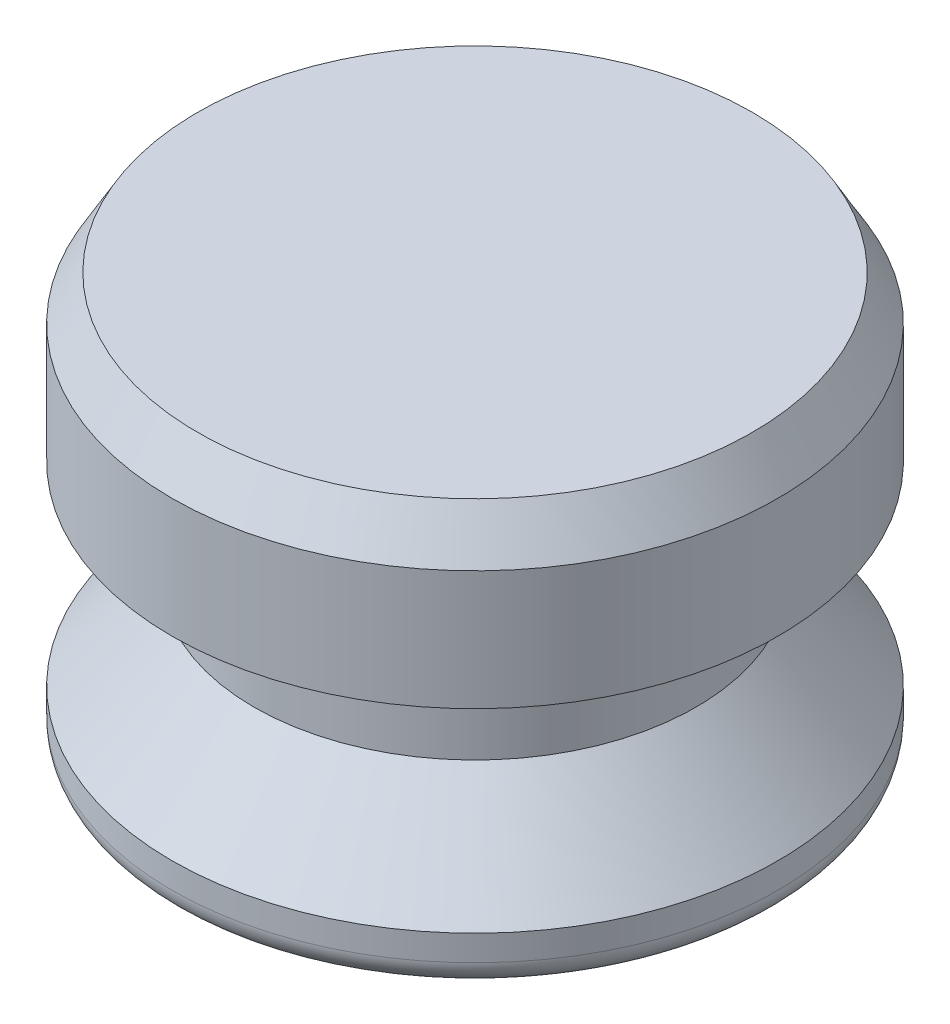
ISO-10303-21;
HEADER;
FILE_DESCRIPTION(('STEP AP214'),'2;1');
FILE_NAME('part.step','',(''),(''),'','','');
FILE_SCHEMA(('AUTOMOTIVE_DESIGN { 1 0 10303 214 1 1 1 1 }'));
ENDSEC;
DATA;
#1=APPLICATION_CONTEXT('core data for automotive mechanical design processes');
#2=APPLICATION_PROTOCOL_DEFINITION('international standard','automotive_design',2000,#1);
#3=PRODUCT_CONTEXT('',#1,'mechanical');
#4=PRODUCT('Part','Part','',(#3));
#5=PRODUCT_RELATED_PRODUCT_CATEGORY('part','',(#4));
#6=PRODUCT_DEFINITION_FORMATION('','',#4);
#7=PRODUCT_DEFINITION_CONTEXT('part definition',#1,'design');
#8=PRODUCT_DEFINITION('design','',#6,#7);
#9=PRODUCT_DEFINITION_SHAPE('','',#8);
#10=(LENGTH_UNIT() NAMED_UNIT(*) SI_UNIT(.MILLI.,.METRE.));
#11=(NAMED_UNIT(*) PLANE_ANGLE_UNIT() SI_UNIT($,.RADIAN.));
#12=(NAMED_UNIT(*) SI_UNIT($,.STERADIAN.) SOLID_ANGLE_UNIT());
#13=UNCERTAINTY_MEASURE_WITH_UNIT(LENGTH_MEASURE(1.E-05),#10,'distance_accuracy_value','');
#14=(GEOMETRIC_REPRESENTATION_CONTEXT(3) GLOBAL_UNCERTAINTY_ASSIGNED_CONTEXT((#13)) GLOBAL_UNIT_ASSIGNED_CONTEXT((#10,
#11,#12)) REPRESENTATION_CONTEXT('',''));
#15=CARTESIAN_POINT('',(0.,0.,0.));
#16=DIRECTION('',(0.,0.,1.));
#17=DIRECTION('',(1.,0.,0.));
#18=AXIS2_PLACEMENT_3D('',#15,#16,#17);
#19=CARTESIAN_POINT('',(0.,0.,0.));
#20=DIRECTION('',(0.,1.,0.));
#21=DIRECTION('',(0.,0.,1.));
#22=AXIS2_PLACEMENT_3D('',#19,#20,#21);
#23=PLANE('',#22);
#24=CARTESIAN_POINT('',(0.,0.,0.));
#25=DIRECTION('',(0.,1.,0.));
#26=DIRECTION('',(0.,0.,1.));
#27=AXIS2_PLACEMENT_3D('',#24,#25,#26);
#28=CIRCLE('',#27,8.60425);
#29=CARTESIAN_POINT('',(0.,0.,8.60425));
#30=VERTEX_POINT('',#29);
#31=EDGE_CURVE('E46',#30,#30,#28,.F.);
#32=ORIENTED_EDGE('',*,*,#31,.T.);
#33=EDGE_LOOP('',(#32));
#34=FACE_BOUND('',#33,.T.);
#35=ADVANCED_FACE('F31',(#34),#23,.F.);
#36=CARTESIAN_POINT('',(0.,0.,0.));
#37=DIRECTION('',(0.,-1.,0.));
#38=DIRECTION('',(0.,0.,-1.));
#39=AXIS2_PLACEMENT_3D('',#36,#37,#38);
#40=CYLINDRICAL_SURFACE('',#39,9.398);
#41=CARTESIAN_POINT('',(0.,0.793749999999999,0.));
#42=DIRECTION('',(0.,1.,0.));
#43=DIRECTION('',(0.,0.,1.));
#44=AXIS2_PLACEMENT_3D('',#41,#42,#43);
#45=CIRCLE('',#44,9.398);
#46=CARTESIAN_POINT('',(0.,0.793749999999999,9.398));
#47=VERTEX_POINT('',#46);
#48=EDGE_CURVE('E42',#47,#47,#45,.T.);
#49=ORIENTED_EDGE('',*,*,#48,.T.);
#50=EDGE_LOOP('',(#49));
#51=FACE_BOUND('',#50,.T.);
#52=CARTESIAN_POINT('',(0.,1.5875,0.));
#53=DIRECTION('',(0.,-1.,0.));
#54=DIRECTION('',(0.,0.,-1.));
#55=AXIS2_PLACEMENT_3D('',#52,#53,#54);
#56=CIRCLE('',#55,9.398);
#57=CARTESIAN_POINT('',(0.,1.5875,-9.398));
#58=VERTEX_POINT('',#57);
#59=EDGE_CURVE('E51',#58,#58,#56,.T.);
#60=ORIENTED_EDGE('',*,*,#59,.T.);
#61=EDGE_LOOP('',(#60));
#62=FACE_BOUND('',#61,.T.);
#63=ADVANCED_FACE('F80',(#51,#62),#40,.T.);
#64=CARTESIAN_POINT('',(0.,4.445,0.));
#65=DIRECTION('',(0.,-1.,0.));
#66=DIRECTION('',(0.,0.,-1.));
#67=AXIS2_PLACEMENT_3D('',#64,#65,#66);
#68=CONICAL_SURFACE('',#67,6.858,0.726642340681726);
#69=ORIENTED_EDGE('',*,*,#59,.F.);
#70=EDGE_LOOP('',(#69));
#71=FACE_BOUND('',#70,.T.);
#72=CARTESIAN_POINT('',(0.,4.445,0.));
#73=DIRECTION('',(0.,-1.,0.));
#74=DIRECTION('',(0.,0.,-1.));
#75=AXIS2_PLACEMENT_3D('',#72,#73,#74);
#76=CIRCLE('',#75,6.858);
#77=CARTESIAN_POINT('',(0.,4.445,-6.858));
#78=VERTEX_POINT('',#77);
#79=EDGE_CURVE('E54',#78,#78,#76,.T.);
#80=ORIENTED_EDGE('',*,*,#79,.T.);
#81=EDGE_LOOP('',(#80));
#82=FACE_BOUND('',#81,.T.);
#83=ADVANCED_FACE('F86',(#71,#82),#68,.T.);
#84=CARTESIAN_POINT('',(0.,0.,0.));
#85=DIRECTION('',(0.,-1.,0.));
#86=DIRECTION('',(0.,0.,-1.));
#87=AXIS2_PLACEMENT_3D('',#84,#85,#86);
#88=CYLINDRICAL_SURFACE('',#87,6.858);
#89=ORIENTED_EDGE('',*,*,#79,.F.);
#90=EDGE_LOOP('',(#89));
#91=FACE_BOUND('',#90,.T.);
#92=CARTESIAN_POINT('',(0.,7.62,0.));
#93=DIRECTION('',(0.,-1.,0.));
#94=DIRECTION('',(0.,0.,-1.));
#95=AXIS2_PLACEMENT_3D('',#92,#93,#94);
#96=CIRCLE('',#95,6.858);
#97=CARTESIAN_POINT('',(0.,7.62,-6.858));
#98=VERTEX_POINT('',#97);
#99=EDGE_CURVE('E57',#98,#98,#96,.T.);
#100=ORIENTED_EDGE('',*,*,#99,.T.);
#101=EDGE_LOOP('',(#100));
#102=FACE_BOUND('',#101,.T.);
#103=ADVANCED_FACE('F76',(#91,#102),#88,.T.);
#104=CARTESIAN_POINT('',(-6.858,7.62,0.));
#105=DIRECTION('',(0.,1.,0.));
#106=DIRECTION('',(0.,0.,1.));
#107=AXIS2_PLACEMENT_3D('',#104,#105,#106);
#108=PLANE('',#107);
#109=ORIENTED_EDGE('',*,*,#99,.F.);
#110=EDGE_LOOP('',(#109));
#111=FACE_BOUND('',#110,.T.);
#112=CARTESIAN_POINT('',(0.,7.62,0.));
#113=DIRECTION('',(0.,-1.,0.));
#114=DIRECTION('',(0.,0.,-1.));
#115=AXIS2_PLACEMENT_3D('',#112,#113,#114);
#116=CIRCLE('',#115,9.398);
#117=CARTESIAN_POINT('',(0.,7.62,-9.398));
#118=VERTEX_POINT('',#117);
#119=EDGE_CURVE('E60',#118,#118,#116,.T.);
#120=ORIENTED_EDGE('',*,*,#119,.T.);
#121=EDGE_LOOP('',(#120));
#122=FACE_BOUND('',#121,.T.);
#123=ADVANCED_FACE('F64',(#111,#122),#108,.F.);
#124=CARTESIAN_POINT('',(0.,0.,0.));
#125=DIRECTION('',(0.,-1.,0.));
#126=DIRECTION('',(0.,0.,-1.));
#127=AXIS2_PLACEMENT_3D('',#124,#125,#126);
#128=CYLINDRICAL_SURFACE('',#127,9.398);
#129=CARTESIAN_POINT('',(0.,11.3251846714922,0.));
#130=DIRECTION('',(0.,-1.,0.));
#131=DIRECTION('',(0.,0.,-1.));
#132=AXIS2_PLACEMENT_3D('',#129,#130,#131);
#133=CIRCLE('',#132,9.398);
#134=CARTESIAN_POINT('',(0.,11.3251846714922,-9.398));
#135=VERTEX_POINT('',#134);
#136=EDGE_CURVE('E38',#135,#135,#133,.T.);
#137=ORIENTED_EDGE('',*,*,#136,.T.);
#138=EDGE_LOOP('',(#137));
#139=FACE_BOUND('',#138,.T.);
#140=ORIENTED_EDGE('',*,*,#119,.F.);
#141=EDGE_LOOP('',(#140));
#142=FACE_BOUND('',#141,.T.);
#143=ADVANCED_FACE('F66',(#139,#142),#128,.T.);
#144=CARTESIAN_POINT('',(-9.398,12.7,0.));
#145=DIRECTION('',(0.,-1.,0.));
#146=DIRECTION('',(0.,0.,-1.));
#147=AXIS2_PLACEMENT_3D('',#144,#145,#146);
#148=PLANE('',#147);
#149=CARTESIAN_POINT('',(0.,12.7,0.));
#150=DIRECTION('',(0.,-1.,0.));
#151=DIRECTION('',(0.,0.,-1.));
#152=AXIS2_PLACEMENT_3D('',#149,#150,#151);
#153=CIRCLE('',#152,8.60424999999999);
#154=CARTESIAN_POINT('',(0.,12.7,-8.60424999999999));
#155=VERTEX_POINT('',#154);
#156=EDGE_CURVE('E10',#155,#155,#153,.F.);
#157=ORIENTED_EDGE('',*,*,#156,.T.);
#158=EDGE_LOOP('',(#157));
#159=FACE_BOUND('',#158,.T.);
#160=ADVANCED_FACE('F68',(#159),#148,.F.);
#161=CARTESIAN_POINT('',(0.,0.793749999999999,0.));
#162=DIRECTION('',(0.,1.,0.));
#163=DIRECTION('',(0.,0.,1.));
#164=AXIS2_PLACEMENT_3D('',#161,#162,#163);
#165=TOROIDAL_SURFACE('',#164,8.60425,0.79375);
#166=ORIENTED_EDGE('',*,*,#48,.F.);
#167=EDGE_LOOP('',(#166));
#168=FACE_BOUND('',#167,.T.);
#169=ORIENTED_EDGE('',*,*,#31,.F.);
#170=EDGE_LOOP('',(#169));
#171=FACE_BOUND('',#170,.T.);
#172=ADVANCED_FACE('F74',(#168,#171),#165,.T.);
#173=CARTESIAN_POINT('',(0.,11.3251846714922,0.));
#174=DIRECTION('',(0.,-1.,0.));
#175=DIRECTION('',(0.,0.,-1.));
#176=AXIS2_PLACEMENT_3D('',#173,#174,#175);
#177=CONICAL_SURFACE('',#176,9.398,0.5235987755983);
#178=ORIENTED_EDGE('',*,*,#156,.F.);
#179=EDGE_LOOP('',(#178));
#180=FACE_BOUND('',#179,.T.);
#181=ORIENTED_EDGE('',*,*,#136,.F.);
#182=EDGE_LOOP('',(#181));
#183=FACE_BOUND('',#182,.T.);
#184=ADVANCED_FACE('F33',(#180,#183),#177,.T.);
#185=CLOSED_SHELL('',(#35,#63,#83,#103,#123,#143,#160,#172,#184));
#186=MANIFOLD_SOLID_BREP('B2',#185);
#187=ADVANCED_BREP_SHAPE_REPRESENTATION('',(#18,#186),#14);
#188=SHAPE_DEFINITION_REPRESENTATION(#9,#187);
ENDSEC;
END-ISO-10303-21;
